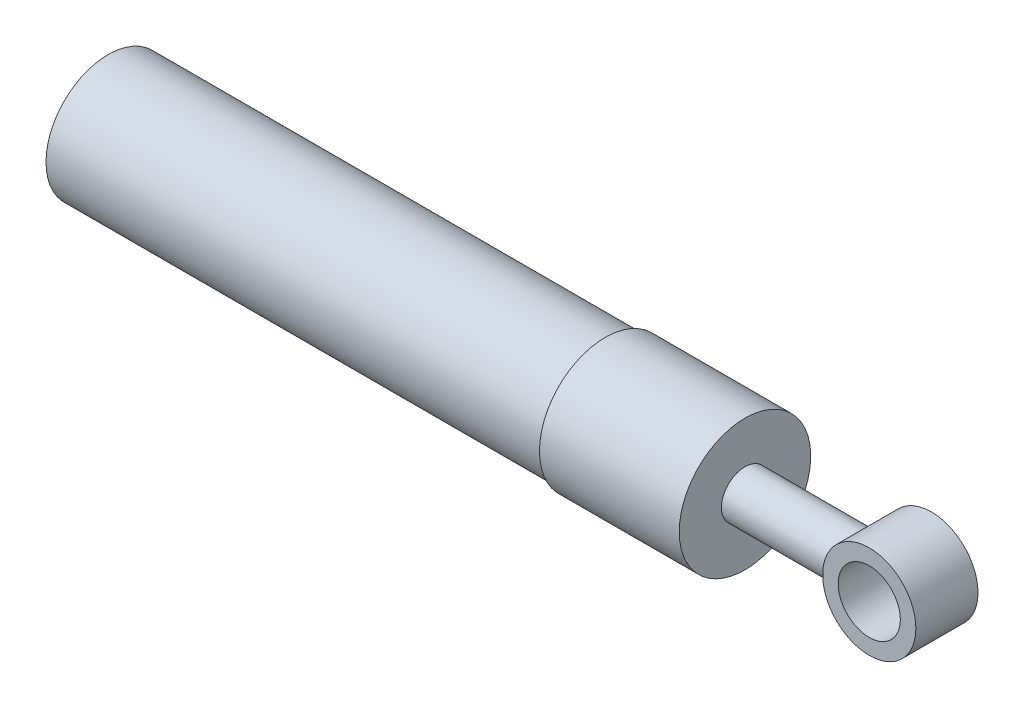
ISO-10303-21;
HEADER;
FILE_DESCRIPTION(('STEP AP214'),'2;1');
FILE_NAME('part.step','',(''),(''),'','','');
FILE_SCHEMA(('AUTOMOTIVE_DESIGN { 1 0 10303 214 1 1 1 1 }'));
ENDSEC;
DATA;
#1=APPLICATION_CONTEXT('core data for automotive mechanical design processes');
#2=APPLICATION_PROTOCOL_DEFINITION('international standard','automotive_design',2000,#1);
#3=PRODUCT_CONTEXT('',#1,'mechanical');
#4=PRODUCT('Part','Part','',(#3));
#5=PRODUCT_RELATED_PRODUCT_CATEGORY('part','',(#4));
#6=PRODUCT_DEFINITION_FORMATION('','',#4);
#7=PRODUCT_DEFINITION_CONTEXT('part definition',#1,'design');
#8=PRODUCT_DEFINITION('design','',#6,#7);
#9=PRODUCT_DEFINITION_SHAPE('','',#8);
#10=(LENGTH_UNIT() NAMED_UNIT(*) SI_UNIT(.MILLI.,.METRE.));
#11=(NAMED_UNIT(*) PLANE_ANGLE_UNIT() SI_UNIT($,.RADIAN.));
#12=(NAMED_UNIT(*) SI_UNIT($,.STERADIAN.) SOLID_ANGLE_UNIT());
#13=UNCERTAINTY_MEASURE_WITH_UNIT(LENGTH_MEASURE(1.E-05),#10,'distance_accuracy_value','');
#14=(GEOMETRIC_REPRESENTATION_CONTEXT(3) GLOBAL_UNCERTAINTY_ASSIGNED_CONTEXT((#13)) GLOBAL_UNIT_ASSIGNED_CONTEXT((#10,
#11,#12)) REPRESENTATION_CONTEXT('',''));
#15=CARTESIAN_POINT('',(0.,0.,0.));
#16=DIRECTION('',(0.,0.,1.));
#17=DIRECTION('',(1.,0.,0.));
#18=AXIS2_PLACEMENT_3D('',#15,#16,#17);
#19=CARTESIAN_POINT('',(0.,0.,0.));
#20=DIRECTION('',(-1.,0.,0.));
#21=DIRECTION('',(0.,0.,1.));
#22=AXIS2_PLACEMENT_3D('',#19,#20,#21);
#23=CYLINDRICAL_SURFACE('',#22,2.413);
#24=CARTESIAN_POINT('',(65.0875,0.,0.));
#25=DIRECTION('',(-1.,0.,0.));
#26=DIRECTION('',(0.,0.,1.));
#27=AXIS2_PLACEMENT_3D('',#24,#25,#26);
#28=CIRCLE('',#27,2.413);
#29=CARTESIAN_POINT('',(65.0875,0.,2.413));
#30=VERTEX_POINT('',#29);
#31=EDGE_CURVE('E76',#30,#30,#28,.T.);
#32=ORIENTED_EDGE('',*,*,#31,.F.);
#33=EDGE_LOOP('',(#32));
#34=FACE_BOUND('',#33,.T.);
#35=CARTESIAN_POINT('',(76.2,0.,2.413));
#36=CARTESIAN_POINT('',(76.2000081198746,-0.126649169989471,2.41299049914035));
#37=CARTESIAN_POINT('',(76.2051063713086,-0.253448771240009,2.40296960860626));
#38=CARTESIAN_POINT('',(76.2250013240939,-0.503284584888762,2.3633319787567));
#39=CARTESIAN_POINT('',(76.2398157868476,-0.626313472406526,2.33367935134709));
#40=CARTESIAN_POINT('',(76.2775944026197,-0.864618839509832,2.25624407821883));
#41=CARTESIAN_POINT('',(76.300526583584,-0.979923651751687,2.2085325082459));
#42=CARTESIAN_POINT('',(76.3524484732067,-1.20071351455458,2.09670819894971));
#43=CARTESIAN_POINT('',(76.3814378087369,-1.30619916940959,2.03259646984207));
#44=CARTESIAN_POINT('',(76.444920413881,-1.51166955891755,1.88530464361434));
#45=CARTESIAN_POINT('',(76.4796427914353,-1.61091451989384,1.80119282127221));
#46=CARTESIAN_POINT('',(76.549949673581,-1.79457367080566,1.6182992768856));
#47=CARTESIAN_POINT('',(76.5855348295089,-1.87897623231331,1.51950616344853));
#48=CARTESIAN_POINT('',(76.6568342261951,-2.0373472926855,1.3005635759747));
#49=CARTESIAN_POINT('',(76.692330067107,-2.1099366693159,1.17933689421039));
#50=CARTESIAN_POINT('',(76.7555756055112,-2.23339117146114,0.924416732090921));
#51=CARTESIAN_POINT('',(76.7833309362505,-2.28427210991042,0.790732412956089));
#52=CARTESIAN_POINT('',(76.8253622990801,-2.35950552281814,0.522919958086683));
#53=CARTESIAN_POINT('',(76.8403524610313,-2.38527718275492,0.389308358781808));
#54=CARTESIAN_POINT('',(76.8570347724665,-2.41389077594304,0.118887463397895));
#55=CARTESIAN_POINT('',(76.8587407138853,-2.41675649067176,-0.0179183682689456));
#56=CARTESIAN_POINT('',(76.8492331929621,-2.40051659080372,-0.272648000126042));
#57=CARTESIAN_POINT('',(76.8395907163059,-2.38408320864943,-0.390815392391941));
#58=CARTESIAN_POINT('',(76.8112340353637,-2.33435392559416,-0.622410650360844));
#59=CARTESIAN_POINT('',(76.7925168080508,-2.30105240532798,-0.735836922991433));
#60=CARTESIAN_POINT('',(76.7477155475378,-2.2179405014121,-0.957971540335886));
#61=CARTESIAN_POINT('',(76.7214705393882,-2.16776471531076,-1.06650916437178));
#62=CARTESIAN_POINT('',(76.6645574391777,-2.05261226003203,-1.27415189582267));
#63=CARTESIAN_POINT('',(76.6338873608544,-1.98762893662852,-1.37325273404975));
#64=CARTESIAN_POINT('',(76.5667396552825,-1.83481041047058,-1.57284130830591));
#65=CARTESIAN_POINT('',(76.5300268272814,-1.74509874440939,-1.67181825988622));
#66=CARTESIAN_POINT('',(76.4581686828007,-1.55022377726655,-1.85396186443355));
#67=CARTESIAN_POINT('',(76.4230241611078,-1.44505275505379,-1.93712056913312));
#68=CARTESIAN_POINT('',(76.3561688036748,-1.21574956455372,-2.08909954588547));
#69=CARTESIAN_POINT('',(76.3247096934133,-1.09094195977516,-2.15702053721547));
#70=CARTESIAN_POINT('',(76.2709360441649,-0.829676205999803,-2.27033780926625));
#71=CARTESIAN_POINT('',(76.2486140649442,-0.693227645922142,-2.31575242297996));
#72=CARTESIAN_POINT('',(76.217231754518,-0.424880869717558,-2.37895264052229));
#73=CARTESIAN_POINT('',(76.207212223911,-0.29356848396422,-2.39874436517171));
#74=CARTESIAN_POINT('',(76.1982555192268,-0.0291243143990897,-2.41645504714242));
#75=CARTESIAN_POINT('',(76.1993128815704,0.10400654010943,-2.41438478768969));
#76=CARTESIAN_POINT('',(76.2118427838188,0.356966618113464,-2.38956028168628));
#77=CARTESIAN_POINT('',(76.222474760774,0.477007494648108,-2.36847515858118));
#78=CARTESIAN_POINT('',(76.2519778082477,0.711595995642831,-2.30886358733806));
#79=CARTESIAN_POINT('',(76.2708497763468,0.826143020149534,-2.27033523909581));
#80=CARTESIAN_POINT('',(76.3157936672273,1.0502184657147,-2.17596156976462));
#81=CARTESIAN_POINT('',(76.3420523552464,1.15951663148594,-2.11966167311342));
#82=CARTESIAN_POINT('',(76.3992678904127,1.36746797186693,-1.99186174621717));
#83=CARTESIAN_POINT('',(76.4302267116987,1.46611664357035,-1.92035532388197));
#84=CARTESIAN_POINT('',(76.4975366991993,1.66045566146343,-1.7559157490604));
#85=CARTESIAN_POINT('',(76.5341173646221,1.75485954041948,-1.66155368848643));
#86=CARTESIAN_POINT('',(76.6063010400373,1.9270898372021,-1.45830605191696));
#87=CARTESIAN_POINT('',(76.6419033119418,2.00490402365912,-1.34940985561131));
#88=CARTESIAN_POINT('',(76.7099333516548,2.14557932835793,-1.11307083855773));
#89=CARTESIAN_POINT('',(76.7420998630843,2.20745276695422,-0.98495813937795));
#90=CARTESIAN_POINT('',(76.7962799555001,2.30810110834239,-0.717994987637566));
#91=CARTESIAN_POINT('',(76.8183069388673,2.34690652223803,-0.579158994362308));
#92=CARTESIAN_POINT('',(76.8469078529111,2.39667650984358,-0.309036268610849));
#93=CARTESIAN_POINT('',(76.8547706413331,2.40997137139681,-0.178318658851088));
#94=CARTESIAN_POINT('',(76.8577809073049,2.41510017437088,0.0836582181977898));
#95=CARTESIAN_POINT('',(76.8529344114353,2.4069442874578,0.214917199304573));
#96=CARTESIAN_POINT('',(76.8324543317219,2.37159568724449,0.460357265351227));
#97=CARTESIAN_POINT('',(76.8179504199769,2.34639260758052,0.574931594800931));
#98=CARTESIAN_POINT('',(76.7811550103809,2.28017249089328,0.798083843821202));
#99=CARTESIAN_POINT('',(76.7588609510713,2.23915025195246,0.906659777458848));
#100=CARTESIAN_POINT('',(76.7071798162895,2.13939345773968,1.12279614976465));
#101=CARTESIAN_POINT('',(76.6774177197354,2.07965672169698,1.22980165679589));
#102=CARTESIAN_POINT('',(76.6147539059681,1.94525312330718,1.43297448052116));
#103=CARTESIAN_POINT('',(76.5818505386771,1.87057839137304,1.52913604251073));
#104=CARTESIAN_POINT('',(76.5116505372771,1.69738591796994,1.72050045610822));
#105=CARTESIAN_POINT('',(76.4743226707082,1.59704956387471,1.81405620274594));
#106=CARTESIAN_POINT('',(76.4032476519812,1.38114473626408,1.98339488081072));
#107=CARTESIAN_POINT('',(76.3695025001588,1.26556783339425,2.05916791190082));
#108=CARTESIAN_POINT('',(76.3088508688812,1.02029109479322,2.19114097060457));
#109=CARTESIAN_POINT('',(76.2820169172796,0.890460384053465,2.24713553940805));
#110=CARTESIAN_POINT('',(76.2496113290075,0.689017661419539,2.3136203275397));
#111=CARTESIAN_POINT('',(76.2401208500998,0.620803069455485,2.33285687078643));
#112=CARTESIAN_POINT('',(76.2240100467873,0.482637383587706,2.36530183028416));
#113=CARTESIAN_POINT('',(76.217388000267,0.412687358330087,2.37851386371059));
#114=CARTESIAN_POINT('',(76.2082347818323,0.285633171872797,2.39671618745443));
#115=CARTESIAN_POINT('',(76.2051535542744,0.228724551392879,2.40281575300326));
#116=CARTESIAN_POINT('',(76.201034299005,0.114554221734786,2.41095986331477));
#117=CARTESIAN_POINT('',(76.1999963267983,0.0572925030071184,2.41300429792023));
#118=CARTESIAN_POINT('',(76.2,0.,2.413));
#119=B_SPLINE_CURVE_WITH_KNOTS('',3,(#35,#36,#37,#38,#39,#40,#41,#42,#43,#44,#45,#46,#47,#48,
#49,#50,#51,#52,#53,#54,#55,#56,#57,#58,#59,#60,#61,#62,#63,#64,#65,#66,#67,#68,#69,#70,#71,#72,
#73,#74,#75,#76,#77,#78,#79,#80,#81,#82,#83,#84,#85,#86,#87,#88,#89,#90,#91,#92,#93,#94,#95,#96,
#97,#98,#99,#100,#101,#102,#103,#104,#105,#106,#107,#108,#109,#110,#111,#112,#113,#114,#115,
#116,#117,#118),.UNSPECIFIED.,.T.,.F.,(4,2,2,2,2,2,2,2,2,2,2,2,2,2,2,2,2,2,2,2,2,2,2,2,2,2,2,2,
2,2,2,2,2,2,2,2,2,2,2,2,2,4),(0.,0.37972493875304,0.760145963260222,1.13908505180002,
1.51800080410008,1.92027098436035,2.3228549365916,2.75771654448942,3.19226084595141,
3.60050561015403,4.00832647015917,4.36573385249239,4.72326037807563,5.08908918981097,
5.45508272341639,5.86889911452435,6.28292289174841,6.71717919099467,7.15108117479049,
7.54841100478899,7.94554486459919,8.31088619266214,8.67626732722213,9.05187688113558,
9.42764463638961,9.84105781272571,10.2547747472458,10.6899997657243,11.1246478421442,
11.5172452764923,11.9096565798085,12.2627433690108,12.6159463651959,12.992802524914,
13.3698577441264,13.7944166296879,14.2192113260918,14.6482972916874,14.862546490938,
15.0766668829149,15.2484390409036,15.4202158650012),.UNSPECIFIED.);
#120=CARTESIAN_POINT('',(76.2,0.,2.413));
#121=VERTEX_POINT('',#120);
#122=EDGE_CURVE('E10',#121,#121,#119,.T.);
#123=ORIENTED_EDGE('',*,*,#122,.F.);
#124=EDGE_LOOP('',(#123));
#125=FACE_BOUND('',#124,.T.);
#126=ADVANCED_FACE('F43',(#34,#125),#23,.T.);
#127=CARTESIAN_POINT('',(0.,0.,0.));
#128=DIRECTION('',(1.,0.,0.));
#129=DIRECTION('',(0.,0.,-1.));
#130=AXIS2_PLACEMENT_3D('',#127,#128,#129);
#131=PLANE('',#130);
#132=CARTESIAN_POINT('',(0.,0.,0.));
#133=DIRECTION('',(-1.,0.,0.));
#134=DIRECTION('',(0.,0.,1.));
#135=AXIS2_PLACEMENT_3D('',#132,#133,#134);
#136=CIRCLE('',#135,6.35);
#137=CARTESIAN_POINT('',(0.,0.,6.35));
#138=VERTEX_POINT('',#137);
#139=EDGE_CURVE('E56',#138,#138,#136,.T.);
#140=ORIENTED_EDGE('',*,*,#139,.T.);
#141=EDGE_LOOP('',(#140));
#142=FACE_BOUND('',#141,.T.);
#143=ADVANCED_FACE('F45',(#142),#131,.F.);
#144=CARTESIAN_POINT('',(0.,0.,0.));
#145=DIRECTION('',(-1.,0.,0.));
#146=DIRECTION('',(0.,0.,1.));
#147=AXIS2_PLACEMENT_3D('',#144,#145,#146);
#148=CYLINDRICAL_SURFACE('',#147,6.35);
#149=ORIENTED_EDGE('',*,*,#139,.F.);
#150=EDGE_LOOP('',(#149));
#151=FACE_BOUND('',#150,.T.);
#152=CARTESIAN_POINT('',(50.8,0.,0.));
#153=DIRECTION('',(-1.,0.,0.));
#154=DIRECTION('',(0.,0.,1.));
#155=AXIS2_PLACEMENT_3D('',#152,#153,#154);
#156=CIRCLE('',#155,6.35);
#157=CARTESIAN_POINT('',(50.8,0.,6.35));
#158=VERTEX_POINT('',#157);
#159=EDGE_CURVE('E61',#158,#158,#156,.T.);
#160=ORIENTED_EDGE('',*,*,#159,.T.);
#161=EDGE_LOOP('',(#160));
#162=FACE_BOUND('',#161,.T.);
#163=ADVANCED_FACE('F121',(#151,#162),#148,.T.);
#164=CARTESIAN_POINT('',(50.8,6.35,0.));
#165=DIRECTION('',(1.,0.,0.));
#166=DIRECTION('',(0.,0.,-1.));
#167=AXIS2_PLACEMENT_3D('',#164,#165,#166);
#168=PLANE('',#167);
#169=ORIENTED_EDGE('',*,*,#159,.F.);
#170=EDGE_LOOP('',(#169));
#171=FACE_BOUND('',#170,.T.);
#172=CARTESIAN_POINT('',(50.8,0.,0.));
#173=DIRECTION('',(-1.,0.,0.));
#174=DIRECTION('',(0.,0.,1.));
#175=AXIS2_PLACEMENT_3D('',#172,#173,#174);
#176=CIRCLE('',#175,6.7183);
#177=CARTESIAN_POINT('',(50.8,0.,6.7183));
#178=VERTEX_POINT('',#177);
#179=EDGE_CURVE('E66',#178,#178,#176,.T.);
#180=ORIENTED_EDGE('',*,*,#179,.T.);
#181=EDGE_LOOP('',(#180));
#182=FACE_BOUND('',#181,.T.);
#183=ADVANCED_FACE('F132',(#171,#182),#168,.F.);
#184=CARTESIAN_POINT('',(0.,0.,0.));
#185=DIRECTION('',(-1.,0.,0.));
#186=DIRECTION('',(0.,0.,1.));
#187=AXIS2_PLACEMENT_3D('',#184,#185,#186);
#188=CYLINDRICAL_SURFACE('',#187,6.7183);
#189=ORIENTED_EDGE('',*,*,#179,.F.);
#190=EDGE_LOOP('',(#189));
#191=FACE_BOUND('',#190,.T.);
#192=CARTESIAN_POINT('',(65.0875,0.,0.));
#193=DIRECTION('',(-1.,0.,0.));
#194=DIRECTION('',(0.,0.,1.));
#195=AXIS2_PLACEMENT_3D('',#192,#193,#194);
#196=CIRCLE('',#195,6.7183);
#197=CARTESIAN_POINT('',(65.0875,0.,6.7183));
#198=VERTEX_POINT('',#197);
#199=EDGE_CURVE('E72',#198,#198,#196,.T.);
#200=ORIENTED_EDGE('',*,*,#199,.T.);
#201=EDGE_LOOP('',(#200));
#202=FACE_BOUND('',#201,.T.);
#203=ADVANCED_FACE('F128',(#191,#202),#188,.T.);
#204=CARTESIAN_POINT('',(65.0875,6.7183,0.));
#205=DIRECTION('',(-1.,0.,0.));
#206=DIRECTION('',(0.,0.,1.));
#207=AXIS2_PLACEMENT_3D('',#204,#205,#206);
#208=PLANE('',#207);
#209=ORIENTED_EDGE('',*,*,#199,.F.);
#210=EDGE_LOOP('',(#209));
#211=FACE_BOUND('',#210,.T.);
#212=ORIENTED_EDGE('',*,*,#31,.T.);
#213=EDGE_LOOP('',(#212));
#214=FACE_BOUND('',#213,.T.);
#215=ADVANCED_FACE('F112',(#211,#214),#208,.F.);
#216=CARTESIAN_POINT('',(80.9625,0.,3.175));
#217=DIRECTION('',(0.,0.,-1.));
#218=DIRECTION('',(-1.,0.,0.));
#219=AXIS2_PLACEMENT_3D('',#216,#217,#218);
#220=CYLINDRICAL_SURFACE('',#219,4.7625);
#221=CARTESIAN_POINT('',(80.9625,0.,-3.175));
#222=DIRECTION('',(0.,0.,1.));
#223=DIRECTION('',(1.,0.,0.));
#224=AXIS2_PLACEMENT_3D('',#221,#222,#223);
#225=CIRCLE('',#224,4.7625);
#226=CARTESIAN_POINT('',(85.725,0.,-3.175));
#227=VERTEX_POINT('',#226);
#228=EDGE_CURVE('E81',#227,#227,#225,.T.);
#229=ORIENTED_EDGE('',*,*,#228,.T.);
#230=EDGE_LOOP('',(#229));
#231=FACE_BOUND('',#230,.T.);
#232=CARTESIAN_POINT('',(80.9625,0.,3.175));
#233=DIRECTION('',(0.,0.,1.));
#234=DIRECTION('',(1.,0.,0.));
#235=AXIS2_PLACEMENT_3D('',#232,#233,#234);
#236=CIRCLE('',#235,4.7625);
#237=CARTESIAN_POINT('',(85.725,0.,3.175));
#238=VERTEX_POINT('',#237);
#239=EDGE_CURVE('E80',#238,#238,#236,.T.);
#240=ORIENTED_EDGE('',*,*,#239,.F.);
#241=EDGE_LOOP('',(#240));
#242=FACE_BOUND('',#241,.T.);
#243=ORIENTED_EDGE('',*,*,#122,.T.);
#244=EDGE_LOOP('',(#243));
#245=FACE_BOUND('',#244,.T.);
#246=ADVANCED_FACE('F103',(#231,#242,#245),#220,.T.);
#247=CARTESIAN_POINT('',(80.9625,0.,3.175));
#248=DIRECTION('',(0.,0.,1.));
#249=DIRECTION('',(1.,0.,0.));
#250=AXIS2_PLACEMENT_3D('',#247,#248,#249);
#251=PLANE('',#250);
#252=ORIENTED_EDGE('',*,*,#239,.T.);
#253=EDGE_LOOP('',(#252));
#254=FACE_BOUND('',#253,.T.);
#255=CARTESIAN_POINT('',(80.9625,0.,3.175));
#256=DIRECTION('',(0.,0.,1.));
#257=DIRECTION('',(1.,0.,0.));
#258=AXIS2_PLACEMENT_3D('',#255,#256,#257);
#259=CIRCLE('',#258,3.175);
#260=CARTESIAN_POINT('',(84.1375,0.,3.175));
#261=VERTEX_POINT('',#260);
#262=EDGE_CURVE('E85',#261,#261,#259,.T.);
#263=ORIENTED_EDGE('',*,*,#262,.F.);
#264=EDGE_LOOP('',(#263));
#265=FACE_BOUND('',#264,.T.);
#266=ADVANCED_FACE('F100',(#254,#265),#251,.T.);
#267=CARTESIAN_POINT('',(80.9625,0.,-3.175));
#268=DIRECTION('',(0.,0.,1.));
#269=DIRECTION('',(1.,0.,0.));
#270=AXIS2_PLACEMENT_3D('',#267,#268,#269);
#271=PLANE('',#270);
#272=ORIENTED_EDGE('',*,*,#228,.F.);
#273=EDGE_LOOP('',(#272));
#274=FACE_BOUND('',#273,.T.);
#275=CARTESIAN_POINT('',(80.9625,0.,-3.175));
#276=DIRECTION('',(0.,0.,1.));
#277=DIRECTION('',(1.,0.,0.));
#278=AXIS2_PLACEMENT_3D('',#275,#276,#277);
#279=CIRCLE('',#278,3.175);
#280=CARTESIAN_POINT('',(84.1375,0.,-3.175));
#281=VERTEX_POINT('',#280);
#282=EDGE_CURVE('E89',#281,#281,#279,.T.);
#283=ORIENTED_EDGE('',*,*,#282,.T.);
#284=EDGE_LOOP('',(#283));
#285=FACE_BOUND('',#284,.T.);
#286=ADVANCED_FACE('F102',(#274,#285),#271,.F.);
#287=CARTESIAN_POINT('',(80.9625,0.,3.175));
#288=DIRECTION('',(0.,0.,-1.));
#289=DIRECTION('',(-1.,0.,0.));
#290=AXIS2_PLACEMENT_3D('',#287,#288,#289);
#291=CYLINDRICAL_SURFACE('',#290,3.175);
#292=ORIENTED_EDGE('',*,*,#262,.T.);
#293=EDGE_LOOP('',(#292));
#294=FACE_BOUND('',#293,.T.);
#295=ORIENTED_EDGE('',*,*,#282,.F.);
#296=EDGE_LOOP('',(#295));
#297=FACE_BOUND('',#296,.T.);
#298=ADVANCED_FACE('F97',(#294,#297),#291,.F.);
#299=CLOSED_SHELL('',(#126,#143,#163,#183,#203,#215,#246,#266,#286,#298));
#300=MANIFOLD_SOLID_BREP('B2',#299);
#301=ADVANCED_BREP_SHAPE_REPRESENTATION('',(#18,#300),#14);
#302=SHAPE_DEFINITION_REPRESENTATION(#9,#301);
ENDSEC;
END-ISO-10303-21;
